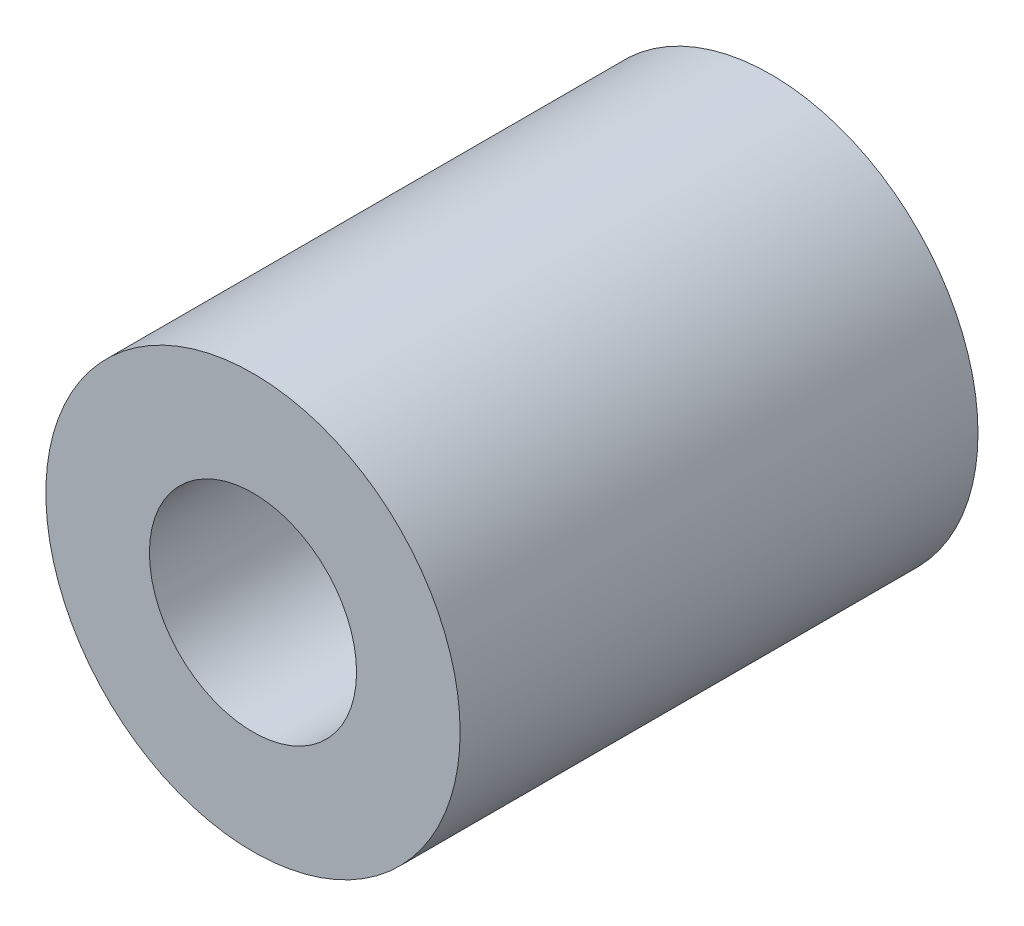
ISO-10303-21;
HEADER;
FILE_DESCRIPTION(('STEP AP214'),'2;1');
FILE_NAME('part.step','',(''),(''),'','','');
FILE_SCHEMA(('AUTOMOTIVE_DESIGN { 1 0 10303 214 1 1 1 1 }'));
ENDSEC;
DATA;
#1=APPLICATION_CONTEXT('core data for automotive mechanical design processes');
#2=APPLICATION_PROTOCOL_DEFINITION('international standard','automotive_design',2000,#1);
#3=PRODUCT_CONTEXT('',#1,'mechanical');
#4=PRODUCT('Part','Part','',(#3));
#5=PRODUCT_RELATED_PRODUCT_CATEGORY('part','',(#4));
#6=PRODUCT_DEFINITION_FORMATION('','',#4);
#7=PRODUCT_DEFINITION_CONTEXT('part definition',#1,'design');
#8=PRODUCT_DEFINITION('design','',#6,#7);
#9=PRODUCT_DEFINITION_SHAPE('','',#8);
#10=(LENGTH_UNIT() NAMED_UNIT(*) SI_UNIT(.MILLI.,.METRE.));
#11=(NAMED_UNIT(*) PLANE_ANGLE_UNIT() SI_UNIT($,.RADIAN.));
#12=(NAMED_UNIT(*) SI_UNIT($,.STERADIAN.) SOLID_ANGLE_UNIT());
#13=UNCERTAINTY_MEASURE_WITH_UNIT(LENGTH_MEASURE(1.E-05),#10,'distance_accuracy_value','');
#14=(GEOMETRIC_REPRESENTATION_CONTEXT(3) GLOBAL_UNCERTAINTY_ASSIGNED_CONTEXT((#13)) GLOBAL_UNIT_ASSIGNED_CONTEXT((#10,
#11,#12)) REPRESENTATION_CONTEXT('',''));
#15=CARTESIAN_POINT('',(0.,0.,0.));
#16=DIRECTION('',(0.,0.,1.));
#17=DIRECTION('',(1.,0.,0.));
#18=AXIS2_PLACEMENT_3D('',#15,#16,#17);
#19=CARTESIAN_POINT('',(0.,0.,12.5));
#20=DIRECTION('',(0.,0.,-1.));
#21=DIRECTION('',(-1.,0.,0.));
#22=AXIS2_PLACEMENT_3D('',#19,#20,#21);
#23=CYLINDRICAL_SURFACE('',#22,10.);
#24=CARTESIAN_POINT('',(0.,0.,12.5));
#25=DIRECTION('',(0.,0.,1.));
#26=DIRECTION('',(1.,0.,0.));
#27=AXIS2_PLACEMENT_3D('',#24,#25,#26);
#28=CIRCLE('',#27,10.);
#29=CARTESIAN_POINT('',(10.,0.,12.5));
#30=VERTEX_POINT('',#29);
#31=EDGE_CURVE('E10',#30,#30,#28,.T.);
#32=ORIENTED_EDGE('',*,*,#31,.F.);
#33=EDGE_LOOP('',(#32));
#34=FACE_BOUND('',#33,.T.);
#35=CARTESIAN_POINT('',(0.,0.,-12.5));
#36=DIRECTION('',(0.,0.,1.));
#37=DIRECTION('',(1.,0.,0.));
#38=AXIS2_PLACEMENT_3D('',#35,#36,#37);
#39=CIRCLE('',#38,10.);
#40=CARTESIAN_POINT('',(10.,0.,-12.5));
#41=VERTEX_POINT('',#40);
#42=EDGE_CURVE('E40',#41,#41,#39,.T.);
#43=ORIENTED_EDGE('',*,*,#42,.T.);
#44=EDGE_LOOP('',(#43));
#45=FACE_BOUND('',#44,.T.);
#46=ADVANCED_FACE('F37',(#34,#45),#23,.T.);
#47=CARTESIAN_POINT('',(0.,0.,12.5));
#48=DIRECTION('',(0.,0.,1.));
#49=DIRECTION('',(1.,0.,0.));
#50=AXIS2_PLACEMENT_3D('',#47,#48,#49);
#51=PLANE('',#50);
#52=CARTESIAN_POINT('',(0.,0.,12.5));
#53=DIRECTION('',(0.,0.,1.));
#54=DIRECTION('',(1.,0.,0.));
#55=AXIS2_PLACEMENT_3D('',#52,#53,#54);
#56=CIRCLE('',#55,5.);
#57=CARTESIAN_POINT('',(5.,0.,12.5));
#58=VERTEX_POINT('',#57);
#59=EDGE_CURVE('E51',#58,#58,#56,.T.);
#60=ORIENTED_EDGE('',*,*,#59,.F.);
#61=EDGE_LOOP('',(#60));
#62=FACE_BOUND('',#61,.T.);
#63=ORIENTED_EDGE('',*,*,#31,.T.);
#64=EDGE_LOOP('',(#63));
#65=FACE_BOUND('',#64,.T.);
#66=ADVANCED_FACE('F79',(#62,#65),#51,.T.);
#67=CARTESIAN_POINT('',(0.,0.,-12.5));
#68=DIRECTION('',(0.,0.,1.));
#69=DIRECTION('',(1.,0.,0.));
#70=AXIS2_PLACEMENT_3D('',#67,#68,#69);
#71=PLANE('',#70);
#72=CARTESIAN_POINT('',(0.,0.,-12.5));
#73=DIRECTION('',(0.,0.,1.));
#74=DIRECTION('',(1.,0.,0.));
#75=AXIS2_PLACEMENT_3D('',#72,#73,#74);
#76=CIRCLE('',#75,5.);
#77=CARTESIAN_POINT('',(5.,0.,-12.5));
#78=VERTEX_POINT('',#77);
#79=EDGE_CURVE('E59',#78,#78,#76,.T.);
#80=ORIENTED_EDGE('',*,*,#79,.T.);
#81=EDGE_LOOP('',(#80));
#82=FACE_BOUND('',#81,.T.);
#83=ORIENTED_EDGE('',*,*,#42,.F.);
#84=EDGE_LOOP('',(#83));
#85=FACE_BOUND('',#84,.T.);
#86=ADVANCED_FACE('F84',(#82,#85),#71,.F.);
#87=CARTESIAN_POINT('',(0.,0.,4.5));
#88=DIRECTION('',(0.,0.,1.));
#89=DIRECTION('',(1.,0.,0.));
#90=AXIS2_PLACEMENT_3D('',#87,#88,#89);
#91=CYLINDRICAL_SURFACE('',#90,5.);
#92=CARTESIAN_POINT('',(0.,0.,4.5));
#93=DIRECTION('',(0.,0.,1.));
#94=DIRECTION('',(1.,0.,0.));
#95=AXIS2_PLACEMENT_3D('',#92,#93,#94);
#96=CIRCLE('',#95,5.);
#97=CARTESIAN_POINT('',(5.,0.,4.5));
#98=VERTEX_POINT('',#97);
#99=EDGE_CURVE('E49',#98,#98,#96,.T.);
#100=ORIENTED_EDGE('',*,*,#99,.F.);
#101=EDGE_LOOP('',(#100));
#102=FACE_BOUND('',#101,.T.);
#103=ORIENTED_EDGE('',*,*,#59,.T.);
#104=EDGE_LOOP('',(#103));
#105=FACE_BOUND('',#104,.T.);
#106=ADVANCED_FACE('F91',(#102,#105),#91,.F.);
#107=CARTESIAN_POINT('',(0.,0.,4.5));
#108=DIRECTION('',(0.,0.,1.));
#109=DIRECTION('',(1.,0.,0.));
#110=AXIS2_PLACEMENT_3D('',#107,#108,#109);
#111=PLANE('',#110);
#112=ORIENTED_EDGE('',*,*,#99,.T.);
#113=EDGE_LOOP('',(#112));
#114=FACE_BOUND('',#113,.T.);
#115=ADVANCED_FACE('F76',(#114),#111,.T.);
#116=CARTESIAN_POINT('',(0.,0.,-4.5));
#117=DIRECTION('',(0.,0.,-1.));
#118=DIRECTION('',(-1.,0.,0.));
#119=AXIS2_PLACEMENT_3D('',#116,#117,#118);
#120=CYLINDRICAL_SURFACE('',#119,5.);
#121=CARTESIAN_POINT('',(0.,0.,-4.5));
#122=DIRECTION('',(0.,0.,1.));
#123=DIRECTION('',(1.,0.,0.));
#124=AXIS2_PLACEMENT_3D('',#121,#122,#123);
#125=CIRCLE('',#124,5.);
#126=CARTESIAN_POINT('',(5.,0.,-4.5));
#127=VERTEX_POINT('',#126);
#128=EDGE_CURVE('E55',#127,#127,#125,.T.);
#129=ORIENTED_EDGE('',*,*,#128,.T.);
#130=EDGE_LOOP('',(#129));
#131=FACE_BOUND('',#130,.T.);
#132=ORIENTED_EDGE('',*,*,#79,.F.);
#133=EDGE_LOOP('',(#132));
#134=FACE_BOUND('',#133,.T.);
#135=ADVANCED_FACE('F67',(#131,#134),#120,.F.);
#136=CARTESIAN_POINT('',(0.,0.,-4.5));
#137=DIRECTION('',(0.,0.,-1.));
#138=DIRECTION('',(1.,0.,0.));
#139=AXIS2_PLACEMENT_3D('',#136,#137,#138);
#140=PLANE('',#139);
#141=ORIENTED_EDGE('',*,*,#128,.F.);
#142=EDGE_LOOP('',(#141));
#143=FACE_BOUND('',#142,.T.);
#144=ADVANCED_FACE('F70',(#143),#140,.T.);
#145=CLOSED_SHELL('',(#46,#66,#86,#106,#115,#135,#144));
#146=MANIFOLD_SOLID_BREP('B2',#145);
#147=ADVANCED_BREP_SHAPE_REPRESENTATION('',(#18,#146),#14);
#148=SHAPE_DEFINITION_REPRESENTATION(#9,#147);
ENDSEC;
END-ISO-10303-21;
